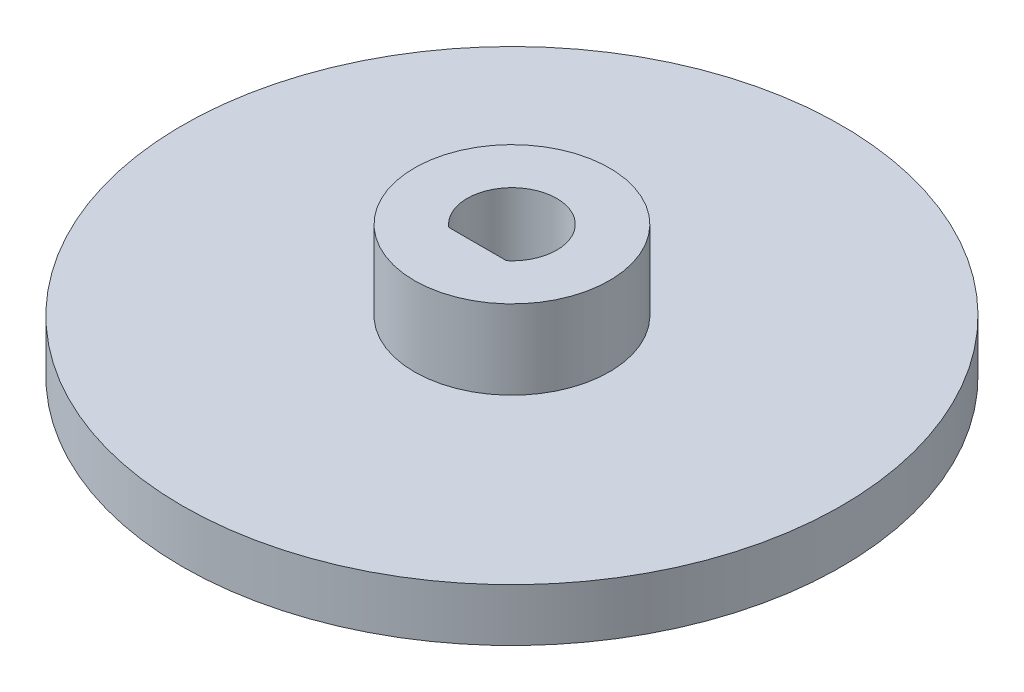
ISO-10303-21;
HEADER;
FILE_DESCRIPTION(('STEP AP214'),'2;1');
FILE_NAME('part.step','',(''),(''),'','','');
FILE_SCHEMA(('AUTOMOTIVE_DESIGN { 1 0 10303 214 1 1 1 1 }'));
ENDSEC;
DATA;
#1=APPLICATION_CONTEXT('core data for automotive mechanical design processes');
#2=APPLICATION_PROTOCOL_DEFINITION('international standard','automotive_design',2000,#1);
#3=PRODUCT_CONTEXT('',#1,'mechanical');
#4=PRODUCT('Part','Part','',(#3));
#5=PRODUCT_RELATED_PRODUCT_CATEGORY('part','',(#4));
#6=PRODUCT_DEFINITION_FORMATION('','',#4);
#7=PRODUCT_DEFINITION_CONTEXT('part definition',#1,'design');
#8=PRODUCT_DEFINITION('design','',#6,#7);
#9=PRODUCT_DEFINITION_SHAPE('','',#8);
#10=(LENGTH_UNIT() NAMED_UNIT(*) SI_UNIT(.MILLI.,.METRE.));
#11=(NAMED_UNIT(*) PLANE_ANGLE_UNIT() SI_UNIT($,.RADIAN.));
#12=(NAMED_UNIT(*) SI_UNIT($,.STERADIAN.) SOLID_ANGLE_UNIT());
#13=UNCERTAINTY_MEASURE_WITH_UNIT(LENGTH_MEASURE(1.E-05),#10,'distance_accuracy_value','');
#14=(GEOMETRIC_REPRESENTATION_CONTEXT(3) GLOBAL_UNCERTAINTY_ASSIGNED_CONTEXT((#13)) GLOBAL_UNIT_ASSIGNED_CONTEXT((#10,
#11,#12)) REPRESENTATION_CONTEXT('',''));
#15=CARTESIAN_POINT('',(0.,0.,0.));
#16=DIRECTION('',(0.,0.,1.));
#17=DIRECTION('',(1.,0.,0.));
#18=AXIS2_PLACEMENT_3D('',#15,#16,#17);
#19=CARTESIAN_POINT('',(0.,2.,0.));
#20=DIRECTION('',(0.,1.,0.));
#21=DIRECTION('',(0.,0.,1.));
#22=AXIS2_PLACEMENT_3D('',#19,#20,#21);
#23=PLANE('',#22);
#24=CARTESIAN_POINT('',(0.,2.,0.));
#25=DIRECTION('',(0.,1.,0.));
#26=DIRECTION('',(0.,0.,1.));
#27=AXIS2_PLACEMENT_3D('',#24,#25,#26);
#28=CIRCLE('',#27,12.5);
#29=CARTESIAN_POINT('',(0.,2.,12.5));
#30=VERTEX_POINT('',#29);
#31=EDGE_CURVE('E79',#30,#30,#28,.T.);
#32=ORIENTED_EDGE('',*,*,#31,.T.);
#33=EDGE_LOOP('',(#32));
#34=FACE_BOUND('',#33,.T.);
#35=CARTESIAN_POINT('',(0.,2.,0.));
#36=DIRECTION('',(0.,1.,0.));
#37=DIRECTION('',(0.,0.,1.));
#38=AXIS2_PLACEMENT_3D('',#35,#36,#37);
#39=CIRCLE('',#38,3.7);
#40=CARTESIAN_POINT('',(0.,2.,3.7));
#41=VERTEX_POINT('',#40);
#42=EDGE_CURVE('E69',#41,#41,#39,.T.);
#43=ORIENTED_EDGE('',*,*,#42,.F.);
#44=EDGE_LOOP('',(#43));
#45=FACE_BOUND('',#44,.T.);
#46=ADVANCED_FACE('F37',(#34,#45),#23,.T.);
#47=CARTESIAN_POINT('',(0.,2.,0.));
#48=DIRECTION('',(0.,-1.,0.));
#49=DIRECTION('',(0.,0.,-1.));
#50=AXIS2_PLACEMENT_3D('',#47,#48,#49);
#51=CYLINDRICAL_SURFACE('',#50,1.7);
#52=CARTESIAN_POINT('',(0.,0.,0.));
#53=DIRECTION('',(0.,1.,0.));
#54=DIRECTION('',(0.,0.,1.));
#55=AXIS2_PLACEMENT_3D('',#52,#53,#54);
#56=CIRCLE('',#55,1.7);
#57=CARTESIAN_POINT('',(1.09544511501033,0.,1.3));
#58=VERTEX_POINT('',#57);
#59=CARTESIAN_POINT('',(-1.09544511501033,0.,1.3));
#60=VERTEX_POINT('',#59);
#61=EDGE_CURVE('E64',#58,#60,#56,.T.);
#62=ORIENTED_EDGE('',*,*,#61,.F.);
#63=DIRECTION('',(0.,-1.,0.));
#64=VECTOR('',#63,1.);
#65=CARTESIAN_POINT('',(1.09544511501033,2.,1.3));
#66=LINE('',#65,#64);
#67=CARTESIAN_POINT('',(1.09544511501033,5.,1.3));
#68=VERTEX_POINT('',#67);
#69=EDGE_CURVE('E11',#68,#58,#66,.T.);
#70=ORIENTED_EDGE('',*,*,#69,.F.);
#71=CARTESIAN_POINT('',(0.,5.,0.));
#72=DIRECTION('',(0.,1.,0.));
#73=DIRECTION('',(0.,0.,-1.));
#74=AXIS2_PLACEMENT_3D('',#71,#72,#73);
#75=CIRCLE('',#74,1.7);
#76=CARTESIAN_POINT('',(-1.09544511501033,5.,1.3));
#77=VERTEX_POINT('',#76);
#78=EDGE_CURVE('E62',#68,#77,#75,.T.);
#79=ORIENTED_EDGE('',*,*,#78,.T.);
#80=DIRECTION('',(0.,-1.,0.));
#81=VECTOR('',#80,1.);
#82=CARTESIAN_POINT('',(-1.09544511501033,2.,1.3));
#83=LINE('',#82,#81);
#84=EDGE_CURVE('E45',#77,#60,#83,.T.);
#85=ORIENTED_EDGE('',*,*,#84,.T.);
#86=EDGE_LOOP('',(#62,#70,#79,#85));
#87=FACE_BOUND('',#86,.T.);
#88=ADVANCED_FACE('F39',(#87),#51,.F.);
#89=CARTESIAN_POINT('',(0.,2.,1.3));
#90=DIRECTION('',(0.,0.,-1.));
#91=DIRECTION('',(-1.,0.,0.));
#92=AXIS2_PLACEMENT_3D('',#89,#90,#91);
#93=PLANE('',#92);
#94=DIRECTION('',(1.,0.,0.));
#95=VECTOR('',#94,1.);
#96=CARTESIAN_POINT('',(0.,0.,1.3));
#97=LINE('',#96,#95);
#98=EDGE_CURVE('E84',#60,#58,#97,.T.);
#99=ORIENTED_EDGE('',*,*,#98,.F.);
#100=ORIENTED_EDGE('',*,*,#84,.F.);
#101=DIRECTION('',(1.,0.,0.));
#102=VECTOR('',#101,1.);
#103=CARTESIAN_POINT('',(-1.09544511501033,5.,1.3));
#104=LINE('',#103,#102);
#105=EDGE_CURVE('E66',#77,#68,#104,.T.);
#106=ORIENTED_EDGE('',*,*,#105,.T.);
#107=ORIENTED_EDGE('',*,*,#69,.T.);
#108=EDGE_LOOP('',(#99,#100,#106,#107));
#109=FACE_BOUND('',#108,.T.);
#110=ADVANCED_FACE('F67',(#109),#93,.T.);
#111=CARTESIAN_POINT('',(0.,2.,0.));
#112=DIRECTION('',(0.,-1.,0.));
#113=DIRECTION('',(0.,0.,-1.));
#114=AXIS2_PLACEMENT_3D('',#111,#112,#113);
#115=CYLINDRICAL_SURFACE('',#114,12.5);
#116=ORIENTED_EDGE('',*,*,#31,.F.);
#117=EDGE_LOOP('',(#116));
#118=FACE_BOUND('',#117,.T.);
#119=CARTESIAN_POINT('',(0.,0.,0.));
#120=DIRECTION('',(0.,1.,0.));
#121=DIRECTION('',(0.,0.,1.));
#122=AXIS2_PLACEMENT_3D('',#119,#120,#121);
#123=CIRCLE('',#122,12.5);
#124=CARTESIAN_POINT('',(0.,0.,12.5));
#125=VERTEX_POINT('',#124);
#126=EDGE_CURVE('E82',#125,#125,#123,.T.);
#127=ORIENTED_EDGE('',*,*,#126,.T.);
#128=EDGE_LOOP('',(#127));
#129=FACE_BOUND('',#128,.T.);
#130=ADVANCED_FACE('F89',(#118,#129),#115,.T.);
#131=CARTESIAN_POINT('',(0.,0.,0.));
#132=DIRECTION('',(0.,1.,0.));
#133=DIRECTION('',(0.,0.,1.));
#134=AXIS2_PLACEMENT_3D('',#131,#132,#133);
#135=PLANE('',#134);
#136=ORIENTED_EDGE('',*,*,#61,.T.);
#137=ORIENTED_EDGE('',*,*,#98,.T.);
#138=EDGE_LOOP('',(#136,#137));
#139=FACE_BOUND('',#138,.T.);
#140=ORIENTED_EDGE('',*,*,#126,.F.);
#141=EDGE_LOOP('',(#140));
#142=FACE_BOUND('',#141,.T.);
#143=ADVANCED_FACE('F91',(#139,#142),#135,.F.);
#144=CARTESIAN_POINT('',(0.,5.,0.));
#145=DIRECTION('',(0.,1.,0.));
#146=DIRECTION('',(0.,0.,1.));
#147=AXIS2_PLACEMENT_3D('',#144,#145,#146);
#148=PLANE('',#147);
#149=CARTESIAN_POINT('',(0.,5.,0.));
#150=DIRECTION('',(0.,1.,0.));
#151=DIRECTION('',(0.,0.,1.));
#152=AXIS2_PLACEMENT_3D('',#149,#150,#151);
#153=CIRCLE('',#152,3.7);
#154=CARTESIAN_POINT('',(0.,5.,3.7));
#155=VERTEX_POINT('',#154);
#156=EDGE_CURVE('E74',#155,#155,#153,.T.);
#157=ORIENTED_EDGE('',*,*,#156,.T.);
#158=EDGE_LOOP('',(#157));
#159=FACE_BOUND('',#158,.T.);
#160=ORIENTED_EDGE('',*,*,#105,.F.);
#161=ORIENTED_EDGE('',*,*,#78,.F.);
#162=EDGE_LOOP('',(#160,#161));
#163=FACE_BOUND('',#162,.T.);
#164=ADVANCED_FACE('F71',(#159,#163),#148,.T.);
#165=CARTESIAN_POINT('',(0.,5.,0.));
#166=DIRECTION('',(0.,-1.,0.));
#167=DIRECTION('',(0.,0.,-1.));
#168=AXIS2_PLACEMENT_3D('',#165,#166,#167);
#169=CYLINDRICAL_SURFACE('',#168,3.7);
#170=ORIENTED_EDGE('',*,*,#156,.F.);
#171=EDGE_LOOP('',(#170));
#172=FACE_BOUND('',#171,.T.);
#173=ORIENTED_EDGE('',*,*,#42,.T.);
#174=EDGE_LOOP('',(#173));
#175=FACE_BOUND('',#174,.T.);
#176=ADVANCED_FACE('F99',(#172,#175),#169,.T.);
#177=CLOSED_SHELL('',(#46,#88,#110,#130,#143,#164,#176));
#178=MANIFOLD_SOLID_BREP('B2',#177);
#179=ADVANCED_BREP_SHAPE_REPRESENTATION('',(#18,#178),#14);
#180=SHAPE_DEFINITION_REPRESENTATION(#9,#179);
ENDSEC;
END-ISO-10303-21;
